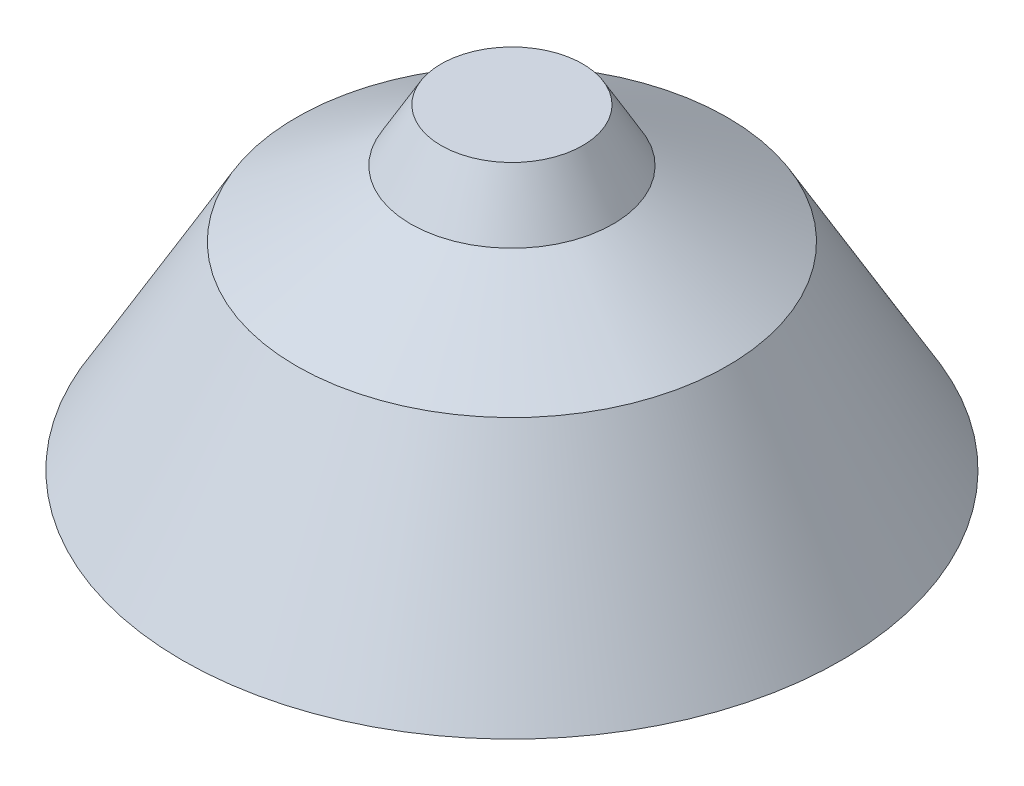
ISO-10303-21;
HEADER;
FILE_DESCRIPTION(('STEP AP214'),'2;1');
FILE_NAME('part.step','',(''),(''),'','','');
FILE_SCHEMA(('AUTOMOTIVE_DESIGN { 1 0 10303 214 1 1 1 1 }'));
ENDSEC;
DATA;
#1=APPLICATION_CONTEXT('core data for automotive mechanical design processes');
#2=APPLICATION_PROTOCOL_DEFINITION('international standard','automotive_design',2000,#1);
#3=PRODUCT_CONTEXT('',#1,'mechanical');
#4=PRODUCT('Part','Part','',(#3));
#5=PRODUCT_RELATED_PRODUCT_CATEGORY('part','',(#4));
#6=PRODUCT_DEFINITION_FORMATION('','',#4);
#7=PRODUCT_DEFINITION_CONTEXT('part definition',#1,'design');
#8=PRODUCT_DEFINITION('design','',#6,#7);
#9=PRODUCT_DEFINITION_SHAPE('','',#8);
#10=(LENGTH_UNIT() NAMED_UNIT(*) SI_UNIT(.MILLI.,.METRE.));
#11=(NAMED_UNIT(*) PLANE_ANGLE_UNIT() SI_UNIT($,.RADIAN.));
#12=(NAMED_UNIT(*) SI_UNIT($,.STERADIAN.) SOLID_ANGLE_UNIT());
#13=UNCERTAINTY_MEASURE_WITH_UNIT(LENGTH_MEASURE(1.E-05),#10,'distance_accuracy_value','');
#14=(GEOMETRIC_REPRESENTATION_CONTEXT(3) GLOBAL_UNCERTAINTY_ASSIGNED_CONTEXT((#13)) GLOBAL_UNIT_ASSIGNED_CONTEXT((#10,
#11,#12)) REPRESENTATION_CONTEXT('',''));
#15=CARTESIAN_POINT('',(0.,0.,0.));
#16=DIRECTION('',(0.,0.,1.));
#17=DIRECTION('',(1.,0.,0.));
#18=AXIS2_PLACEMENT_3D('',#15,#16,#17);
#19=CARTESIAN_POINT('',(0.,0.,-286.368581012383));
#20=DIRECTION('',(0.,1.,0.));
#21=DIRECTION('',(0.,0.,1.));
#22=AXIS2_PLACEMENT_3D('',#19,#20,#21);
#23=PLANE('',#22);
#24=CARTESIAN_POINT('',(0.,0.,-286.368581012383));
#25=DIRECTION('',(0.,1.,0.));
#26=DIRECTION('',(0.,0.,1.));
#27=AXIS2_PLACEMENT_3D('',#24,#25,#26);
#28=CIRCLE('',#27,2442.26497308103);
#29=CARTESIAN_POINT('',(0.,0.,2155.89639206865));
#30=VERTEX_POINT('',#29);
#31=EDGE_CURVE('E65',#30,#30,#28,.T.);
#32=ORIENTED_EDGE('',*,*,#31,.T.);
#33=EDGE_LOOP('',(#32));
#34=FACE_BOUND('',#33,.T.);
#35=CARTESIAN_POINT('',(0.,0.,-286.368581012383));
#36=DIRECTION('',(0.,1.,0.));
#37=DIRECTION('',(0.,0.,1.));
#38=AXIS2_PLACEMENT_3D('',#35,#36,#37);
#39=CIRCLE('',#38,2500.);
#40=CARTESIAN_POINT('',(0.,0.,2213.63141898762));
#41=VERTEX_POINT('',#40);
#42=EDGE_CURVE('E59',#41,#41,#39,.T.);
#43=ORIENTED_EDGE('',*,*,#42,.F.);
#44=EDGE_LOOP('',(#43));
#45=FACE_BOUND('',#44,.T.);
#46=ADVANCED_FACE('F43',(#34,#45),#23,.F.);
#47=CARTESIAN_POINT('',(0.,1500.,-286.368581012383));
#48=DIRECTION('',(0.,-1.,0.));
#49=DIRECTION('',(0.,0.,-1.));
#50=AXIS2_PLACEMENT_3D('',#47,#48,#49);
#51=CONICAL_SURFACE('',#50,1633.97459621556,0.523598775598296);
#52=ORIENTED_EDGE('',*,*,#42,.T.);
#53=EDGE_LOOP('',(#52));
#54=FACE_BOUND('',#53,.T.);
#55=CARTESIAN_POINT('',(0.,1500.,-286.368581012383));
#56=DIRECTION('',(0.,1.,0.));
#57=DIRECTION('',(0.,0.,1.));
#58=AXIS2_PLACEMENT_3D('',#55,#56,#57);
#59=CIRCLE('',#58,1633.97459621556);
#60=CARTESIAN_POINT('',(0.,1500.,1347.60601520318));
#61=VERTEX_POINT('',#60);
#62=EDGE_CURVE('E55',#61,#61,#59,.T.);
#63=ORIENTED_EDGE('',*,*,#62,.F.);
#64=EDGE_LOOP('',(#63));
#65=FACE_BOUND('',#64,.T.);
#66=ADVANCED_FACE('F97',(#54,#65),#51,.T.);
#67=CARTESIAN_POINT('',(0.,2000.,-286.368581012383));
#68=DIRECTION('',(0.,-1.,0.));
#69=DIRECTION('',(0.,0.,-1.));
#70=AXIS2_PLACEMENT_3D('',#67,#68,#69);
#71=CONICAL_SURFACE('',#70,767.949192431121,1.0471975511966);
#72=ORIENTED_EDGE('',*,*,#62,.T.);
#73=EDGE_LOOP('',(#72));
#74=FACE_BOUND('',#73,.T.);
#75=CARTESIAN_POINT('',(0.,2000.,-286.368581012383));
#76=DIRECTION('',(0.,1.,0.));
#77=DIRECTION('',(0.,0.,1.));
#78=AXIS2_PLACEMENT_3D('',#75,#76,#77);
#79=CIRCLE('',#78,767.949192431121);
#80=CARTESIAN_POINT('',(0.,2000.,481.580611418739));
#81=VERTEX_POINT('',#80);
#82=EDGE_CURVE('E51',#81,#81,#79,.T.);
#83=ORIENTED_EDGE('',*,*,#82,.F.);
#84=EDGE_LOOP('',(#83));
#85=FACE_BOUND('',#84,.T.);
#86=ADVANCED_FACE('F103',(#74,#85),#71,.T.);
#87=CARTESIAN_POINT('',(-2.22044604925031E-13,2400.,-286.368581012383));
#88=DIRECTION('',(0.,1.,0.));
#89=DIRECTION('',(0.,0.,1.));
#90=AXIS2_PLACEMENT_3D('',#87,#88,#89);
#91=PLANE('',#90);
#92=CARTESIAN_POINT('',(-2.22044604925031E-13,2400.,-286.368581012383));
#93=DIRECTION('',(0.,1.,0.));
#94=DIRECTION('',(0.,0.,1.));
#95=AXIS2_PLACEMENT_3D('',#92,#93,#94);
#96=CIRCLE('',#95,537.009084755273);
#97=CARTESIAN_POINT('',(-2.22044604925031E-13,2400.,250.64050374289));
#98=VERTEX_POINT('',#97);
#99=EDGE_CURVE('E10',#98,#98,#96,.T.);
#100=ORIENTED_EDGE('',*,*,#99,.T.);
#101=EDGE_LOOP('',(#100));
#102=FACE_BOUND('',#101,.T.);
#103=ADVANCED_FACE('F108',(#102),#91,.T.);
#104=CARTESIAN_POINT('',(-2.22044604925031E-13,2400.,-286.368581012383));
#105=DIRECTION('',(0.,-1.,0.));
#106=DIRECTION('',(0.,0.,-1.));
#107=AXIS2_PLACEMENT_3D('',#104,#105,#106);
#108=CONICAL_SURFACE('',#107,537.009084755273,0.523598775598296);
#109=ORIENTED_EDGE('',*,*,#82,.T.);
#110=EDGE_LOOP('',(#109));
#111=FACE_BOUND('',#110,.T.);
#112=ORIENTED_EDGE('',*,*,#99,.F.);
#113=EDGE_LOOP('',(#112));
#114=FACE_BOUND('',#113,.T.);
#115=ADVANCED_FACE('F46',(#111,#114),#108,.T.);
#116=CARTESIAN_POINT('',(0.,1475.,-286.368581012383));
#117=DIRECTION('',(0.,-1.,0.));
#118=DIRECTION('',(0.,0.,-1.));
#119=AXIS2_PLACEMENT_3D('',#116,#117,#118);
#120=CONICAL_SURFACE('',#119,1590.67332602634,0.523598775598296);
#121=ORIENTED_EDGE('',*,*,#31,.F.);
#122=EDGE_LOOP('',(#121));
#123=FACE_BOUND('',#122,.T.);
#124=CARTESIAN_POINT('',(0.,1463.39745962155,-286.368581012383));
#125=DIRECTION('',(0.,1.,0.));
#126=DIRECTION('',(0.,0.,1.));
#127=AXIS2_PLACEMENT_3D('',#124,#125,#126);
#128=CIRCLE('',#127,1597.37205583712);
#129=CARTESIAN_POINT('',(0.,1463.39745962155,1311.00347482474));
#130=VERTEX_POINT('',#129);
#131=EDGE_CURVE('E68',#130,#130,#128,.T.);
#132=ORIENTED_EDGE('',*,*,#131,.T.);
#133=EDGE_LOOP('',(#132));
#134=FACE_BOUND('',#133,.T.);
#135=ADVANCED_FACE('F77',(#123,#134),#120,.F.);
#136=CARTESIAN_POINT('',(0.,1956.69872981078,-286.368581012383));
#137=DIRECTION('',(0.,-1.,0.));
#138=DIRECTION('',(0.,0.,-1.));
#139=AXIS2_PLACEMENT_3D('',#136,#137,#138);
#140=CONICAL_SURFACE('',#139,742.949192431121,1.0471975511966);
#141=ORIENTED_EDGE('',*,*,#131,.F.);
#142=EDGE_LOOP('',(#141));
#143=FACE_BOUND('',#142,.T.);
#144=CARTESIAN_POINT('',(0.,1963.39745962156,-286.368581012383));
#145=DIRECTION('',(0.,1.,0.));
#146=DIRECTION('',(0.,0.,1.));
#147=AXIS2_PLACEMENT_3D('',#144,#145,#146);
#148=CIRCLE('',#147,731.346652052678);
#149=CARTESIAN_POINT('',(0.,1963.39745962156,444.978071040295));
#150=VERTEX_POINT('',#149);
#151=EDGE_CURVE('E71',#150,#150,#148,.T.);
#152=ORIENTED_EDGE('',*,*,#151,.T.);
#153=EDGE_LOOP('',(#152));
#154=FACE_BOUND('',#153,.T.);
#155=ADVANCED_FACE('F79',(#143,#154),#140,.F.);
#156=CARTESIAN_POINT('',(-2.22044604925031E-13,2350.,-286.368581012383));
#157=DIRECTION('',(0.,1.,0.));
#158=DIRECTION('',(0.,0.,1.));
#159=AXIS2_PLACEMENT_3D('',#156,#157,#158);
#160=PLANE('',#159);
#161=CARTESIAN_POINT('',(-2.22044604925031E-13,2350.,-286.368581012383));
#162=DIRECTION('',(0.,1.,0.));
#163=DIRECTION('',(0.,0.,1.));
#164=AXIS2_PLACEMENT_3D('',#161,#162,#163);
#165=CIRCLE('',#164,508.141571295791);
#166=CARTESIAN_POINT('',(-2.22044604925031E-13,2350.,221.772990283408));
#167=VERTEX_POINT('',#166);
#168=EDGE_CURVE('E64',#167,#167,#165,.T.);
#169=ORIENTED_EDGE('',*,*,#168,.F.);
#170=EDGE_LOOP('',(#169));
#171=FACE_BOUND('',#170,.T.);
#172=ADVANCED_FACE('F82',(#171),#160,.F.);
#173=CARTESIAN_POINT('',(-2.22044604925031E-13,2375.,-286.368581012383));
#174=DIRECTION('',(0.,-1.,0.));
#175=DIRECTION('',(0.,0.,-1.));
#176=AXIS2_PLACEMENT_3D('',#173,#174,#175);
#177=CONICAL_SURFACE('',#176,493.707814566051,0.523598775598296);
#178=ORIENTED_EDGE('',*,*,#151,.F.);
#179=EDGE_LOOP('',(#178));
#180=FACE_BOUND('',#179,.T.);
#181=ORIENTED_EDGE('',*,*,#168,.T.);
#182=EDGE_LOOP('',(#181));
#183=FACE_BOUND('',#182,.T.);
#184=ADVANCED_FACE('F86',(#180,#183),#177,.F.);
#185=CLOSED_SHELL('',(#46,#66,#86,#103,#115,#135,#155,#172,#184));
#186=MANIFOLD_SOLID_BREP('B2',#185);
#187=ADVANCED_BREP_SHAPE_REPRESENTATION('',(#18,#186),#14);
#188=SHAPE_DEFINITION_REPRESENTATION(#9,#187);
ENDSEC;
END-ISO-10303-21;
